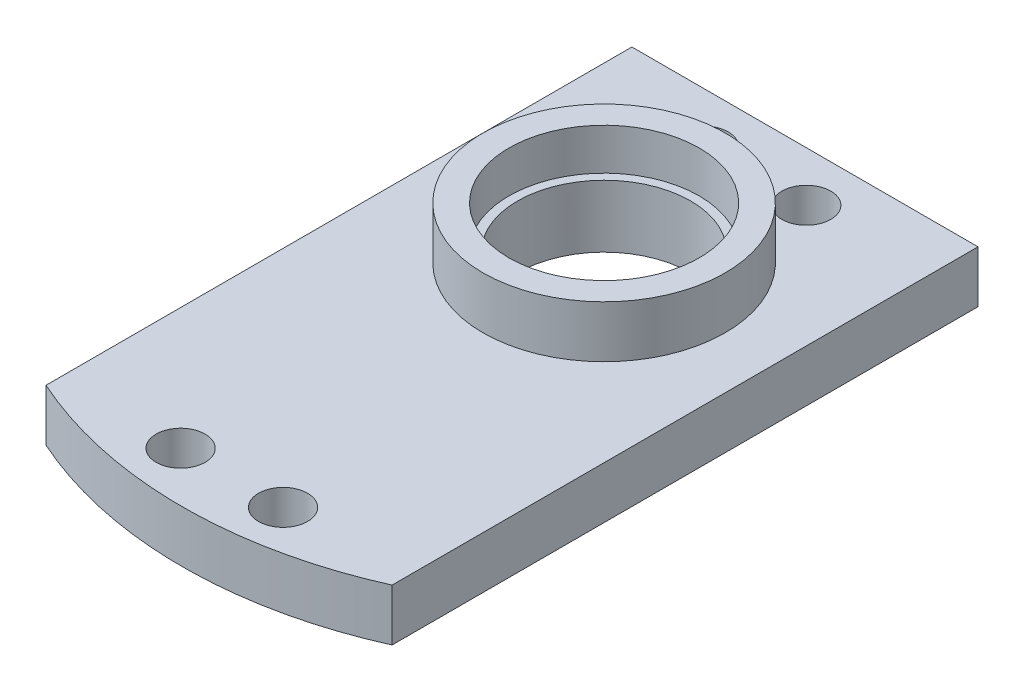
ISO-10303-21;
HEADER;
FILE_DESCRIPTION(('STEP AP214'),'2;1');
FILE_NAME('part.step','',(''),(''),'','','');
FILE_SCHEMA(('AUTOMOTIVE_DESIGN { 1 0 10303 214 1 1 1 1 }'));
ENDSEC;
DATA;
#1=APPLICATION_CONTEXT('core data for automotive mechanical design processes');
#2=APPLICATION_PROTOCOL_DEFINITION('international standard','automotive_design',2000,#1);
#3=PRODUCT_CONTEXT('',#1,'mechanical');
#4=PRODUCT('Part','Part','',(#3));
#5=PRODUCT_RELATED_PRODUCT_CATEGORY('part','',(#4));
#6=PRODUCT_DEFINITION_FORMATION('','',#4);
#7=PRODUCT_DEFINITION_CONTEXT('part definition',#1,'design');
#8=PRODUCT_DEFINITION('design','',#6,#7);
#9=PRODUCT_DEFINITION_SHAPE('','',#8);
#10=(LENGTH_UNIT() NAMED_UNIT(*) SI_UNIT(.MILLI.,.METRE.));
#11=(NAMED_UNIT(*) PLANE_ANGLE_UNIT() SI_UNIT($,.RADIAN.));
#12=(NAMED_UNIT(*) SI_UNIT($,.STERADIAN.) SOLID_ANGLE_UNIT());
#13=UNCERTAINTY_MEASURE_WITH_UNIT(LENGTH_MEASURE(1.E-05),#10,'distance_accuracy_value','');
#14=(GEOMETRIC_REPRESENTATION_CONTEXT(3) GLOBAL_UNCERTAINTY_ASSIGNED_CONTEXT((#13)) GLOBAL_UNIT_ASSIGNED_CONTEXT((#10,
#11,#12)) REPRESENTATION_CONTEXT('',''));
#15=CARTESIAN_POINT('',(0.,0.,0.));
#16=DIRECTION('',(0.,0.,1.));
#17=DIRECTION('',(1.,0.,0.));
#18=AXIS2_PLACEMENT_3D('',#15,#16,#17);
#19=CARTESIAN_POINT('',(0.,4.7625,0.));
#20=DIRECTION('',(0.,1.,0.));
#21=DIRECTION('',(0.,0.,1.));
#22=AXIS2_PLACEMENT_3D('',#19,#20,#21);
#23=PLANE('',#22);
#24=CARTESIAN_POINT('',(4.7,4.7625,-24.00000002));
#25=DIRECTION('',(0.,1.,0.));
#26=DIRECTION('',(0.,0.,1.));
#27=AXIS2_PLACEMENT_3D('',#24,#25,#26);
#28=CIRCLE('',#27,2.24789999999999);
#29=CARTESIAN_POINT('',(4.7,4.7625,-21.75210002));
#30=VERTEX_POINT('',#29);
#31=EDGE_CURVE('E157',#30,#30,#28,.T.);
#32=ORIENTED_EDGE('',*,*,#31,.F.);
#33=EDGE_LOOP('',(#32));
#34=FACE_BOUND('',#33,.T.);
#35=CARTESIAN_POINT('',(-4.7,4.7625,23.99999998));
#36=DIRECTION('',(0.,1.,0.));
#37=DIRECTION('',(0.,0.,1.));
#38=AXIS2_PLACEMENT_3D('',#35,#36,#37);
#39=CIRCLE('',#38,2.24789999999999);
#40=CARTESIAN_POINT('',(-4.7,4.7625,26.24789998));
#41=VERTEX_POINT('',#40);
#42=EDGE_CURVE('E151',#41,#41,#39,.T.);
#43=ORIENTED_EDGE('',*,*,#42,.F.);
#44=EDGE_LOOP('',(#43));
#45=FACE_BOUND('',#44,.T.);
#46=CARTESIAN_POINT('',(-4.7,4.7625,-24.00000002));
#47=DIRECTION('',(0.,1.,0.));
#48=DIRECTION('',(0.,0.,1.));
#49=AXIS2_PLACEMENT_3D('',#46,#47,#48);
#50=CIRCLE('',#49,2.24789999999999);
#51=CARTESIAN_POINT('',(-4.7,4.7625,-21.75210002));
#52=VERTEX_POINT('',#51);
#53=EDGE_CURVE('E145',#52,#52,#50,.T.);
#54=ORIENTED_EDGE('',*,*,#53,.F.);
#55=EDGE_LOOP('',(#54));
#56=FACE_BOUND('',#55,.T.);
#57=CARTESIAN_POINT('',(4.7,4.7625,23.99999998));
#58=DIRECTION('',(0.,1.,0.));
#59=DIRECTION('',(0.,0.,1.));
#60=AXIS2_PLACEMENT_3D('',#57,#58,#59);
#61=CIRCLE('',#60,2.24789999999999);
#62=CARTESIAN_POINT('',(4.7,4.7625,26.24789998));
#63=VERTEX_POINT('',#62);
#64=EDGE_CURVE('E139',#63,#63,#61,.T.);
#65=ORIENTED_EDGE('',*,*,#64,.F.);
#66=EDGE_LOOP('',(#65));
#67=FACE_BOUND('',#66,.T.);
#68=CARTESIAN_POINT('',(0.,4.7625,-10.15000002));
#69=DIRECTION('',(0.,1.,0.));
#70=DIRECTION('',(0.,0.,1.));
#71=AXIS2_PLACEMENT_3D('',#68,#69,#70);
#72=CIRCLE('',#71,11.1125);
#73=CARTESIAN_POINT('',(0.,4.7625,0.962499979999998));
#74=VERTEX_POINT('',#73);
#75=EDGE_CURVE('E117',#74,#74,#72,.T.);
#76=ORIENTED_EDGE('',*,*,#75,.F.);
#77=EDGE_LOOP('',(#76));
#78=FACE_BOUND('',#77,.T.);
#79=DIRECTION('',(0.,0.,1.));
#80=VECTOR('',#79,1.);
#81=CARTESIAN_POINT('',(-15.875,4.7625,28.575));
#82=LINE('',#81,#80);
#83=CARTESIAN_POINT('',(-15.875,4.7625,-28.575));
#84=VERTEX_POINT('',#83);
#85=CARTESIAN_POINT('',(-15.875,4.7625,25.1715231853914));
#86=VERTEX_POINT('',#85);
#87=EDGE_CURVE('E123',#84,#86,#82,.T.);
#88=ORIENTED_EDGE('',*,*,#87,.T.);
#89=CARTESIAN_POINT('',(0.,4.7625,-10.15000002));
#90=DIRECTION('',(0.,1.,0.));
#91=DIRECTION('',(0.,0.,1.));
#92=AXIS2_PLACEMENT_3D('',#89,#90,#91);
#93=CIRCLE('',#92,38.72500002);
#94=CARTESIAN_POINT('',(15.875,4.7625,25.1715231853914));
#95=VERTEX_POINT('',#94);
#96=EDGE_CURVE('E102',#86,#95,#93,.T.);
#97=ORIENTED_EDGE('',*,*,#96,.T.);
#98=DIRECTION('',(0.,0.,-1.));
#99=VECTOR('',#98,1.);
#100=CARTESIAN_POINT('',(15.875,4.7625,28.575));
#101=LINE('',#100,#99);
#102=CARTESIAN_POINT('',(15.875,4.7625,-28.575));
#103=VERTEX_POINT('',#102);
#104=EDGE_CURVE('E124',#95,#103,#101,.T.);
#105=ORIENTED_EDGE('',*,*,#104,.T.);
#106=DIRECTION('',(-1.,0.,0.));
#107=VECTOR('',#106,1.);
#108=CARTESIAN_POINT('',(15.875,4.7625,-28.575));
#109=LINE('',#108,#107);
#110=EDGE_CURVE('E69',#103,#84,#109,.T.);
#111=ORIENTED_EDGE('',*,*,#110,.T.);
#112=EDGE_LOOP('',(#88,#97,#105,#111));
#113=FACE_BOUND('',#112,.T.);
#114=ADVANCED_FACE('F51',(#34,#45,#56,#67,#78,#113),#23,.T.);
#115=CARTESIAN_POINT('',(0.,0.,0.));
#116=DIRECTION('',(0.,1.,0.));
#117=DIRECTION('',(0.,0.,1.));
#118=AXIS2_PLACEMENT_3D('',#115,#116,#117);
#119=PLANE('',#118);
#120=CARTESIAN_POINT('',(4.7,0.,-24.00000002));
#121=DIRECTION('',(0.,-1.,0.));
#122=DIRECTION('',(0.,0.,-1.));
#123=AXIS2_PLACEMENT_3D('',#120,#121,#122);
#124=CIRCLE('',#123,2.24789999999999);
#125=CARTESIAN_POINT('',(4.7,0.,-26.24790002));
#126=VERTEX_POINT('',#125);
#127=EDGE_CURVE('E160',#126,#126,#124,.T.);
#128=ORIENTED_EDGE('',*,*,#127,.F.);
#129=EDGE_LOOP('',(#128));
#130=FACE_BOUND('',#129,.T.);
#131=CARTESIAN_POINT('',(-4.7,0.,23.99999998));
#132=DIRECTION('',(0.,-1.,0.));
#133=DIRECTION('',(0.,0.,-1.));
#134=AXIS2_PLACEMENT_3D('',#131,#132,#133);
#135=CIRCLE('',#134,2.24789999999999);
#136=CARTESIAN_POINT('',(-4.7,0.,21.75209998));
#137=VERTEX_POINT('',#136);
#138=EDGE_CURVE('E154',#137,#137,#135,.T.);
#139=ORIENTED_EDGE('',*,*,#138,.F.);
#140=EDGE_LOOP('',(#139));
#141=FACE_BOUND('',#140,.T.);
#142=CARTESIAN_POINT('',(-4.7,0.,-24.00000002));
#143=DIRECTION('',(0.,-1.,0.));
#144=DIRECTION('',(0.,0.,-1.));
#145=AXIS2_PLACEMENT_3D('',#142,#143,#144);
#146=CIRCLE('',#145,2.24789999999999);
#147=CARTESIAN_POINT('',(-4.7,0.,-26.24790002));
#148=VERTEX_POINT('',#147);
#149=EDGE_CURVE('E148',#148,#148,#146,.T.);
#150=ORIENTED_EDGE('',*,*,#149,.F.);
#151=EDGE_LOOP('',(#150));
#152=FACE_BOUND('',#151,.T.);
#153=CARTESIAN_POINT('',(4.7,0.,23.99999998));
#154=DIRECTION('',(0.,-1.,0.));
#155=DIRECTION('',(0.,0.,-1.));
#156=AXIS2_PLACEMENT_3D('',#153,#154,#155);
#157=CIRCLE('',#156,2.24789999999999);
#158=CARTESIAN_POINT('',(4.7,0.,21.75209998));
#159=VERTEX_POINT('',#158);
#160=EDGE_CURVE('E142',#159,#159,#157,.T.);
#161=ORIENTED_EDGE('',*,*,#160,.F.);
#162=EDGE_LOOP('',(#161));
#163=FACE_BOUND('',#162,.T.);
#164=CARTESIAN_POINT('',(0.,0.,-10.15000002));
#165=DIRECTION('',(0.,-1.,0.));
#166=DIRECTION('',(0.,0.,-1.));
#167=AXIS2_PLACEMENT_3D('',#164,#165,#166);
#168=CIRCLE('',#167,7.9375);
#169=CARTESIAN_POINT('',(0.,0.,-18.08750002));
#170=VERTEX_POINT('',#169);
#171=EDGE_CURVE('E136',#170,#170,#168,.T.);
#172=ORIENTED_EDGE('',*,*,#171,.F.);
#173=EDGE_LOOP('',(#172));
#174=FACE_BOUND('',#173,.T.);
#175=CARTESIAN_POINT('',(0.,0.,-10.15000002));
#176=DIRECTION('',(0.,1.,0.));
#177=DIRECTION('',(0.,0.,1.));
#178=AXIS2_PLACEMENT_3D('',#175,#176,#177);
#179=CIRCLE('',#178,38.72500002);
#180=CARTESIAN_POINT('',(-15.875,0.,25.1715231853914));
#181=VERTEX_POINT('',#180);
#182=CARTESIAN_POINT('',(15.875,0.,25.1715231853914));
#183=VERTEX_POINT('',#182);
#184=EDGE_CURVE('E89',#181,#183,#179,.T.);
#185=ORIENTED_EDGE('',*,*,#184,.F.);
#186=DIRECTION('',(0.,0.,1.));
#187=VECTOR('',#186,1.);
#188=CARTESIAN_POINT('',(-15.875,0.,28.575));
#189=LINE('',#188,#187);
#190=CARTESIAN_POINT('',(-15.875,0.,-28.575));
#191=VERTEX_POINT('',#190);
#192=EDGE_CURVE('E100',#191,#181,#189,.T.);
#193=ORIENTED_EDGE('',*,*,#192,.F.);
#194=DIRECTION('',(-1.,0.,0.));
#195=VECTOR('',#194,1.);
#196=CARTESIAN_POINT('',(15.875,0.,-28.575));
#197=LINE('',#196,#195);
#198=CARTESIAN_POINT('',(15.875,0.,-28.575));
#199=VERTEX_POINT('',#198);
#200=EDGE_CURVE('E114',#199,#191,#197,.T.);
#201=ORIENTED_EDGE('',*,*,#200,.F.);
#202=DIRECTION('',(0.,0.,-1.));
#203=VECTOR('',#202,1.);
#204=CARTESIAN_POINT('',(15.875,0.,28.575));
#205=LINE('',#204,#203);
#206=EDGE_CURVE('E80',#183,#199,#205,.T.);
#207=ORIENTED_EDGE('',*,*,#206,.F.);
#208=EDGE_LOOP('',(#185,#193,#201,#207));
#209=FACE_BOUND('',#208,.T.);
#210=ADVANCED_FACE('F97',(#130,#141,#152,#163,#174,#209),#119,.F.);
#211=CARTESIAN_POINT('',(-15.875,4.7625,28.575));
#212=DIRECTION('',(1.,0.,0.));
#213=DIRECTION('',(0.,0.,-1.));
#214=AXIS2_PLACEMENT_3D('',#211,#212,#213);
#215=PLANE('',#214);
#216=DIRECTION('',(0.,1.,0.));
#217=VECTOR('',#216,1.);
#218=CARTESIAN_POINT('',(-15.875,0.,25.1715231853914));
#219=LINE('',#218,#217);
#220=EDGE_CURVE('E105',#181,#86,#219,.T.);
#221=ORIENTED_EDGE('',*,*,#220,.T.);
#222=ORIENTED_EDGE('',*,*,#87,.F.);
#223=DIRECTION('',(0.,-1.,0.));
#224=VECTOR('',#223,1.);
#225=CARTESIAN_POINT('',(-15.875,4.7625,-28.575));
#226=LINE('',#225,#224);
#227=EDGE_CURVE('E61',#84,#191,#226,.T.);
#228=ORIENTED_EDGE('',*,*,#227,.T.);
#229=ORIENTED_EDGE('',*,*,#192,.T.);
#230=EDGE_LOOP('',(#221,#222,#228,#229));
#231=FACE_BOUND('',#230,.T.);
#232=ADVANCED_FACE('F53',(#231),#215,.F.);
#233=CARTESIAN_POINT('',(15.875,4.7625,28.575));
#234=DIRECTION('',(-1.,0.,0.));
#235=DIRECTION('',(0.,0.,1.));
#236=AXIS2_PLACEMENT_3D('',#233,#234,#235);
#237=PLANE('',#236);
#238=DIRECTION('',(0.,1.,0.));
#239=VECTOR('',#238,1.);
#240=CARTESIAN_POINT('',(15.875,0.,25.1715231853914));
#241=LINE('',#240,#239);
#242=EDGE_CURVE('E101',#183,#95,#241,.T.);
#243=ORIENTED_EDGE('',*,*,#242,.F.);
#244=ORIENTED_EDGE('',*,*,#206,.T.);
#245=DIRECTION('',(0.,-1.,0.));
#246=VECTOR('',#245,1.);
#247=CARTESIAN_POINT('',(15.875,4.7625,-28.575));
#248=LINE('',#247,#246);
#249=EDGE_CURVE('E12',#103,#199,#248,.T.);
#250=ORIENTED_EDGE('',*,*,#249,.F.);
#251=ORIENTED_EDGE('',*,*,#104,.F.);
#252=EDGE_LOOP('',(#243,#244,#250,#251));
#253=FACE_BOUND('',#252,.T.);
#254=ADVANCED_FACE('F164',(#253),#237,.F.);
#255=CARTESIAN_POINT('',(15.875,4.7625,-28.575));
#256=DIRECTION('',(0.,0.,1.));
#257=DIRECTION('',(1.,0.,0.));
#258=AXIS2_PLACEMENT_3D('',#255,#256,#257);
#259=PLANE('',#258);
#260=ORIENTED_EDGE('',*,*,#200,.T.);
#261=ORIENTED_EDGE('',*,*,#227,.F.);
#262=ORIENTED_EDGE('',*,*,#110,.F.);
#263=ORIENTED_EDGE('',*,*,#249,.T.);
#264=EDGE_LOOP('',(#260,#261,#262,#263));
#265=FACE_BOUND('',#264,.T.);
#266=ADVANCED_FACE('F166',(#265),#259,.F.);
#267=CARTESIAN_POINT('',(0.,9.525,-10.15000002));
#268=DIRECTION('',(0.,-1.,0.));
#269=DIRECTION('',(0.,0.,-1.));
#270=AXIS2_PLACEMENT_3D('',#267,#268,#269);
#271=CYLINDRICAL_SURFACE('',#270,11.1125);
#272=CARTESIAN_POINT('',(0.,9.525,-10.15000002));
#273=DIRECTION('',(0.,1.,0.));
#274=DIRECTION('',(0.,0.,1.));
#275=AXIS2_PLACEMENT_3D('',#272,#273,#274);
#276=CIRCLE('',#275,11.1125);
#277=CARTESIAN_POINT('',(0.,9.525,0.962499979999998));
#278=VERTEX_POINT('',#277);
#279=EDGE_CURVE('E112',#278,#278,#276,.T.);
#280=ORIENTED_EDGE('',*,*,#279,.F.);
#281=EDGE_LOOP('',(#280));
#282=FACE_BOUND('',#281,.T.);
#283=ORIENTED_EDGE('',*,*,#75,.T.);
#284=EDGE_LOOP('',(#283));
#285=FACE_BOUND('',#284,.T.);
#286=ADVANCED_FACE('F168',(#282,#285),#271,.T.);
#287=CARTESIAN_POINT('',(0.,9.525,-10.15000002));
#288=DIRECTION('',(0.,1.,0.));
#289=DIRECTION('',(0.,0.,1.));
#290=AXIS2_PLACEMENT_3D('',#287,#288,#289);
#291=PLANE('',#290);
#292=CARTESIAN_POINT('',(0.,9.525,-10.15000002));
#293=DIRECTION('',(0.,1.,0.));
#294=DIRECTION('',(0.,0.,1.));
#295=AXIS2_PLACEMENT_3D('',#292,#293,#294);
#296=CIRCLE('',#295,8.73125);
#297=CARTESIAN_POINT('',(0.,9.525,-1.41875002));
#298=VERTEX_POINT('',#297);
#299=EDGE_CURVE('E131',#298,#298,#296,.T.);
#300=ORIENTED_EDGE('',*,*,#299,.F.);
#301=EDGE_LOOP('',(#300));
#302=FACE_BOUND('',#301,.T.);
#303=ORIENTED_EDGE('',*,*,#279,.T.);
#304=EDGE_LOOP('',(#303));
#305=FACE_BOUND('',#304,.T.);
#306=ADVANCED_FACE('F174',(#302,#305),#291,.T.);
#307=CARTESIAN_POINT('',(0.,5.715,-10.15000002));
#308=DIRECTION('',(0.,1.,0.));
#309=DIRECTION('',(0.,0.,1.));
#310=AXIS2_PLACEMENT_3D('',#307,#308,#309);
#311=CYLINDRICAL_SURFACE('',#310,8.73125);
#312=CARTESIAN_POINT('',(0.,5.715,-10.15000002));
#313=DIRECTION('',(0.,1.,0.));
#314=DIRECTION('',(0.,0.,1.));
#315=AXIS2_PLACEMENT_3D('',#312,#313,#314);
#316=CIRCLE('',#315,8.73125);
#317=CARTESIAN_POINT('',(0.,5.715,-1.41875002));
#318=VERTEX_POINT('',#317);
#319=EDGE_CURVE('E129',#318,#318,#316,.T.);
#320=ORIENTED_EDGE('',*,*,#319,.F.);
#321=EDGE_LOOP('',(#320));
#322=FACE_BOUND('',#321,.T.);
#323=ORIENTED_EDGE('',*,*,#299,.T.);
#324=EDGE_LOOP('',(#323));
#325=FACE_BOUND('',#324,.T.);
#326=ADVANCED_FACE('F190',(#322,#325),#311,.F.);
#327=CARTESIAN_POINT('',(0.,5.715,-10.15000002));
#328=DIRECTION('',(0.,1.,0.));
#329=DIRECTION('',(0.,0.,1.));
#330=AXIS2_PLACEMENT_3D('',#327,#328,#329);
#331=PLANE('',#330);
#332=CARTESIAN_POINT('',(0.,5.715,-10.15000002));
#333=DIRECTION('',(0.,1.,0.));
#334=DIRECTION('',(0.,0.,1.));
#335=AXIS2_PLACEMENT_3D('',#332,#333,#334);
#336=CIRCLE('',#335,7.9375);
#337=CARTESIAN_POINT('',(0.,5.715,-2.21250002));
#338=VERTEX_POINT('',#337);
#339=EDGE_CURVE('E55',#338,#338,#336,.T.);
#340=ORIENTED_EDGE('',*,*,#339,.F.);
#341=EDGE_LOOP('',(#340));
#342=FACE_BOUND('',#341,.T.);
#343=ORIENTED_EDGE('',*,*,#319,.T.);
#344=EDGE_LOOP('',(#343));
#345=FACE_BOUND('',#344,.T.);
#346=ADVANCED_FACE('F194',(#342,#345),#331,.T.);
#347=CARTESIAN_POINT('',(0.,7.9375,-10.15000002));
#348=DIRECTION('',(0.,-1.,0.));
#349=DIRECTION('',(0.,0.,-1.));
#350=AXIS2_PLACEMENT_3D('',#347,#348,#349);
#351=CYLINDRICAL_SURFACE('',#350,7.9375);
#352=ORIENTED_EDGE('',*,*,#339,.T.);
#353=EDGE_LOOP('',(#352));
#354=FACE_BOUND('',#353,.T.);
#355=ORIENTED_EDGE('',*,*,#171,.T.);
#356=EDGE_LOOP('',(#355));
#357=FACE_BOUND('',#356,.T.);
#358=ADVANCED_FACE('F198',(#354,#357),#351,.F.);
#359=CARTESIAN_POINT('',(4.7,0.,23.99999998));
#360=DIRECTION('',(0.,-1.,0.));
#361=DIRECTION('',(0.,0.,-1.));
#362=AXIS2_PLACEMENT_3D('',#359,#360,#361);
#363=CYLINDRICAL_SURFACE('',#362,2.24789999999999);
#364=ORIENTED_EDGE('',*,*,#64,.T.);
#365=EDGE_LOOP('',(#364));
#366=FACE_BOUND('',#365,.T.);
#367=ORIENTED_EDGE('',*,*,#160,.T.);
#368=EDGE_LOOP('',(#367));
#369=FACE_BOUND('',#368,.T.);
#370=ADVANCED_FACE('F202',(#366,#369),#363,.F.);
#371=CARTESIAN_POINT('',(-4.7,0.,-24.00000002));
#372=DIRECTION('',(0.,-1.,0.));
#373=DIRECTION('',(0.,0.,-1.));
#374=AXIS2_PLACEMENT_3D('',#371,#372,#373);
#375=CYLINDRICAL_SURFACE('',#374,2.24789999999999);
#376=ORIENTED_EDGE('',*,*,#53,.T.);
#377=EDGE_LOOP('',(#376));
#378=FACE_BOUND('',#377,.T.);
#379=ORIENTED_EDGE('',*,*,#149,.T.);
#380=EDGE_LOOP('',(#379));
#381=FACE_BOUND('',#380,.T.);
#382=ADVANCED_FACE('F206',(#378,#381),#375,.F.);
#383=CARTESIAN_POINT('',(-4.7,0.,23.99999998));
#384=DIRECTION('',(0.,-1.,0.));
#385=DIRECTION('',(0.,0.,-1.));
#386=AXIS2_PLACEMENT_3D('',#383,#384,#385);
#387=CYLINDRICAL_SURFACE('',#386,2.24789999999999);
#388=ORIENTED_EDGE('',*,*,#42,.T.);
#389=EDGE_LOOP('',(#388));
#390=FACE_BOUND('',#389,.T.);
#391=ORIENTED_EDGE('',*,*,#138,.T.);
#392=EDGE_LOOP('',(#391));
#393=FACE_BOUND('',#392,.T.);
#394=ADVANCED_FACE('F210',(#390,#393),#387,.F.);
#395=CARTESIAN_POINT('',(4.7,0.,-24.00000002));
#396=DIRECTION('',(0.,-1.,0.));
#397=DIRECTION('',(0.,0.,-1.));
#398=AXIS2_PLACEMENT_3D('',#395,#396,#397);
#399=CYLINDRICAL_SURFACE('',#398,2.24789999999999);
#400=ORIENTED_EDGE('',*,*,#31,.T.);
#401=EDGE_LOOP('',(#400));
#402=FACE_BOUND('',#401,.T.);
#403=ORIENTED_EDGE('',*,*,#127,.T.);
#404=EDGE_LOOP('',(#403));
#405=FACE_BOUND('',#404,.T.);
#406=ADVANCED_FACE('F214',(#402,#405),#399,.F.);
#407=CARTESIAN_POINT('',(0.,0.,-10.15000002));
#408=DIRECTION('',(0.,1.,0.));
#409=DIRECTION('',(0.,0.,1.));
#410=AXIS2_PLACEMENT_3D('',#407,#408,#409);
#411=CYLINDRICAL_SURFACE('',#410,38.72500002);
#412=ORIENTED_EDGE('',*,*,#96,.F.);
#413=ORIENTED_EDGE('',*,*,#220,.F.);
#414=ORIENTED_EDGE('',*,*,#184,.T.);
#415=ORIENTED_EDGE('',*,*,#242,.T.);
#416=EDGE_LOOP('',(#412,#413,#414,#415));
#417=FACE_BOUND('',#416,.T.);
#418=ADVANCED_FACE('F106',(#417),#411,.T.);
#419=CLOSED_SHELL('',(#114,#210,#232,#254,#266,#286,#306,#326,#346,#358,#370,#382,#394,#406,#418));
#420=MANIFOLD_SOLID_BREP('B2',#419);
#421=ADVANCED_BREP_SHAPE_REPRESENTATION('',(#18,#420),#14);
#422=SHAPE_DEFINITION_REPRESENTATION(#9,#421);
ENDSEC;
END-ISO-10303-21;
